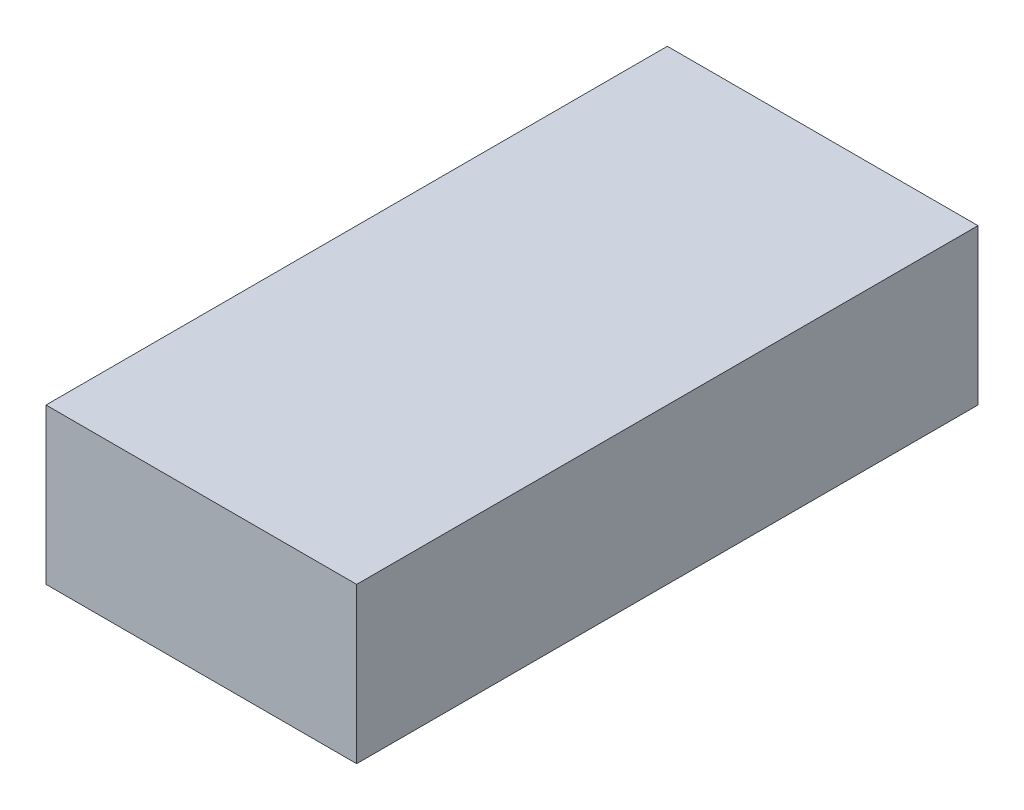
ISO-10303-21;
HEADER;
FILE_DESCRIPTION(('STEP AP214'),'2;1');
FILE_NAME('part.step','',(''),(''),'','','');
FILE_SCHEMA(('AUTOMOTIVE_DESIGN { 1 0 10303 214 1 1 1 1 }'));
ENDSEC;
DATA;
#1=APPLICATION_CONTEXT('core data for automotive mechanical design processes');
#2=APPLICATION_PROTOCOL_DEFINITION('international standard','automotive_design',2000,#1);
#3=PRODUCT_CONTEXT('',#1,'mechanical');
#4=PRODUCT('Part','Part','',(#3));
#5=PRODUCT_RELATED_PRODUCT_CATEGORY('part','',(#4));
#6=PRODUCT_DEFINITION_FORMATION('','',#4);
#7=PRODUCT_DEFINITION_CONTEXT('part definition',#1,'design');
#8=PRODUCT_DEFINITION('design','',#6,#7);
#9=PRODUCT_DEFINITION_SHAPE('','',#8);
#10=(LENGTH_UNIT() NAMED_UNIT(*) SI_UNIT(.MILLI.,.METRE.));
#11=(NAMED_UNIT(*) PLANE_ANGLE_UNIT() SI_UNIT($,.RADIAN.));
#12=(NAMED_UNIT(*) SI_UNIT($,.STERADIAN.) SOLID_ANGLE_UNIT());
#13=UNCERTAINTY_MEASURE_WITH_UNIT(LENGTH_MEASURE(1.E-05),#10,'distance_accuracy_value','');
#14=(GEOMETRIC_REPRESENTATION_CONTEXT(3) GLOBAL_UNCERTAINTY_ASSIGNED_CONTEXT((#13)) GLOBAL_UNIT_ASSIGNED_CONTEXT((#10,
#11,#12)) REPRESENTATION_CONTEXT('',''));
#15=CARTESIAN_POINT('',(0.,0.,0.));
#16=DIRECTION('',(0.,0.,1.));
#17=DIRECTION('',(1.,0.,0.));
#18=AXIS2_PLACEMENT_3D('',#15,#16,#17);
#19=CARTESIAN_POINT('',(5.,-2.5,20.));
#20=DIRECTION('',(-1.,0.,0.));
#21=DIRECTION('',(0.,0.,1.));
#22=AXIS2_PLACEMENT_3D('',#19,#20,#21);
#23=PLANE('',#22);
#24=DIRECTION('',(0.,1.,0.));
#25=VECTOR('',#24,1.);
#26=CARTESIAN_POINT('',(5.,-2.5,0.));
#27=LINE('',#26,#25);
#28=CARTESIAN_POINT('',(5.,-2.5,0.));
#29=VERTEX_POINT('',#28);
#30=CARTESIAN_POINT('',(5.,2.5,0.));
#31=VERTEX_POINT('',#30);
#32=EDGE_CURVE('E96',#29,#31,#27,.T.);
#33=ORIENTED_EDGE('',*,*,#32,.T.);
#34=DIRECTION('',(0.,0.,-1.));
#35=VECTOR('',#34,1.);
#36=CARTESIAN_POINT('',(5.,2.5,20.));
#37=LINE('',#36,#35);
#38=CARTESIAN_POINT('',(5.,2.5,20.));
#39=VERTEX_POINT('',#38);
#40=EDGE_CURVE('E11',#39,#31,#37,.T.);
#41=ORIENTED_EDGE('',*,*,#40,.F.);
#42=DIRECTION('',(0.,1.,0.));
#43=VECTOR('',#42,1.);
#44=CARTESIAN_POINT('',(5.,-2.5,20.));
#45=LINE('',#44,#43);
#46=CARTESIAN_POINT('',(5.,-2.5,20.));
#47=VERTEX_POINT('',#46);
#48=EDGE_CURVE('E84',#47,#39,#45,.T.);
#49=ORIENTED_EDGE('',*,*,#48,.F.);
#50=DIRECTION('',(0.,0.,-1.));
#51=VECTOR('',#50,1.);
#52=CARTESIAN_POINT('',(5.,-2.5,20.));
#53=LINE('',#52,#51);
#54=EDGE_CURVE('E92',#47,#29,#53,.T.);
#55=ORIENTED_EDGE('',*,*,#54,.T.);
#56=EDGE_LOOP('',(#33,#41,#49,#55));
#57=FACE_BOUND('',#56,.T.);
#58=ADVANCED_FACE('F33',(#57),#23,.F.);
#59=CARTESIAN_POINT('',(-5.,2.5,20.));
#60=DIRECTION('',(0.,-1.,0.));
#61=DIRECTION('',(0.,0.,-1.));
#62=AXIS2_PLACEMENT_3D('',#59,#60,#61);
#63=PLANE('',#62);
#64=DIRECTION('',(-1.,0.,0.));
#65=VECTOR('',#64,1.);
#66=CARTESIAN_POINT('',(-5.,2.5,0.));
#67=LINE('',#66,#65);
#68=CARTESIAN_POINT('',(-5.,2.5,0.));
#69=VERTEX_POINT('',#68);
#70=EDGE_CURVE('E88',#31,#69,#67,.T.);
#71=ORIENTED_EDGE('',*,*,#70,.T.);
#72=DIRECTION('',(0.,0.,-1.));
#73=VECTOR('',#72,1.);
#74=CARTESIAN_POINT('',(-5.,2.5,20.));
#75=LINE('',#74,#73);
#76=CARTESIAN_POINT('',(-5.,2.5,20.));
#77=VERTEX_POINT('',#76);
#78=EDGE_CURVE('E41',#77,#69,#75,.T.);
#79=ORIENTED_EDGE('',*,*,#78,.F.);
#80=DIRECTION('',(-1.,0.,0.));
#81=VECTOR('',#80,1.);
#82=CARTESIAN_POINT('',(-5.,2.5,20.));
#83=LINE('',#82,#81);
#84=EDGE_CURVE('E79',#39,#77,#83,.T.);
#85=ORIENTED_EDGE('',*,*,#84,.F.);
#86=ORIENTED_EDGE('',*,*,#40,.T.);
#87=EDGE_LOOP('',(#71,#79,#85,#86));
#88=FACE_BOUND('',#87,.T.);
#89=ADVANCED_FACE('F87',(#88),#63,.F.);
#90=CARTESIAN_POINT('',(-5.,-2.5,20.));
#91=DIRECTION('',(1.,0.,0.));
#92=DIRECTION('',(0.,0.,-1.));
#93=AXIS2_PLACEMENT_3D('',#90,#91,#92);
#94=PLANE('',#93);
#95=DIRECTION('',(0.,-1.,0.));
#96=VECTOR('',#95,1.);
#97=CARTESIAN_POINT('',(-5.,-2.5,0.));
#98=LINE('',#97,#96);
#99=CARTESIAN_POINT('',(-5.,-2.5,0.));
#100=VERTEX_POINT('',#99);
#101=EDGE_CURVE('E66',#69,#100,#98,.T.);
#102=ORIENTED_EDGE('',*,*,#101,.T.);
#103=DIRECTION('',(0.,0.,-1.));
#104=VECTOR('',#103,1.);
#105=CARTESIAN_POINT('',(-5.,-2.5,20.));
#106=LINE('',#105,#104);
#107=CARTESIAN_POINT('',(-5.,-2.5,20.));
#108=VERTEX_POINT('',#107);
#109=EDGE_CURVE('E89',#108,#100,#106,.T.);
#110=ORIENTED_EDGE('',*,*,#109,.F.);
#111=DIRECTION('',(0.,-1.,0.));
#112=VECTOR('',#111,1.);
#113=CARTESIAN_POINT('',(-5.,-2.5,20.));
#114=LINE('',#113,#112);
#115=EDGE_CURVE('E82',#77,#108,#114,.T.);
#116=ORIENTED_EDGE('',*,*,#115,.F.);
#117=ORIENTED_EDGE('',*,*,#78,.T.);
#118=EDGE_LOOP('',(#102,#110,#116,#117));
#119=FACE_BOUND('',#118,.T.);
#120=ADVANCED_FACE('F90',(#119),#94,.F.);
#121=CARTESIAN_POINT('',(-5.,-2.5,20.));
#122=DIRECTION('',(0.,1.,0.));
#123=DIRECTION('',(0.,0.,1.));
#124=AXIS2_PLACEMENT_3D('',#121,#122,#123);
#125=PLANE('',#124);
#126=DIRECTION('',(1.,0.,0.));
#127=VECTOR('',#126,1.);
#128=CARTESIAN_POINT('',(-5.,-2.5,0.));
#129=LINE('',#128,#127);
#130=EDGE_CURVE('E72',#100,#29,#129,.T.);
#131=ORIENTED_EDGE('',*,*,#130,.T.);
#132=ORIENTED_EDGE('',*,*,#54,.F.);
#133=DIRECTION('',(1.,0.,0.));
#134=VECTOR('',#133,1.);
#135=CARTESIAN_POINT('',(-5.,-2.5,20.));
#136=LINE('',#135,#134);
#137=EDGE_CURVE('E49',#108,#47,#136,.T.);
#138=ORIENTED_EDGE('',*,*,#137,.F.);
#139=ORIENTED_EDGE('',*,*,#109,.T.);
#140=EDGE_LOOP('',(#131,#132,#138,#139));
#141=FACE_BOUND('',#140,.T.);
#142=ADVANCED_FACE('F103',(#141),#125,.F.);
#143=CARTESIAN_POINT('',(0.,0.,20.));
#144=DIRECTION('',(0.,0.,-1.));
#145=DIRECTION('',(-1.,0.,0.));
#146=AXIS2_PLACEMENT_3D('',#143,#144,#145);
#147=PLANE('',#146);
#148=ORIENTED_EDGE('',*,*,#48,.T.);
#149=ORIENTED_EDGE('',*,*,#84,.T.);
#150=ORIENTED_EDGE('',*,*,#115,.T.);
#151=ORIENTED_EDGE('',*,*,#137,.T.);
#152=EDGE_LOOP('',(#148,#149,#150,#151));
#153=FACE_BOUND('',#152,.T.);
#154=ADVANCED_FACE('F80',(#153),#147,.F.);
#155=CARTESIAN_POINT('',(0.,0.,0.));
#156=DIRECTION('',(0.,0.,-1.));
#157=DIRECTION('',(-1.,0.,0.));
#158=AXIS2_PLACEMENT_3D('',#155,#156,#157);
#159=PLANE('',#158);
#160=ORIENTED_EDGE('',*,*,#32,.F.);
#161=ORIENTED_EDGE('',*,*,#130,.F.);
#162=ORIENTED_EDGE('',*,*,#101,.F.);
#163=ORIENTED_EDGE('',*,*,#70,.F.);
#164=EDGE_LOOP('',(#160,#161,#162,#163));
#165=FACE_BOUND('',#164,.T.);
#166=ADVANCED_FACE('F106',(#165),#159,.T.);
#167=CLOSED_SHELL('',(#58,#89,#120,#142,#154,#166));
#168=MANIFOLD_SOLID_BREP('B2',#167);
#169=ADVANCED_BREP_SHAPE_REPRESENTATION('',(#18,#168),#14);
#170=SHAPE_DEFINITION_REPRESENTATION(#9,#169);
ENDSEC;
END-ISO-10303-21;
